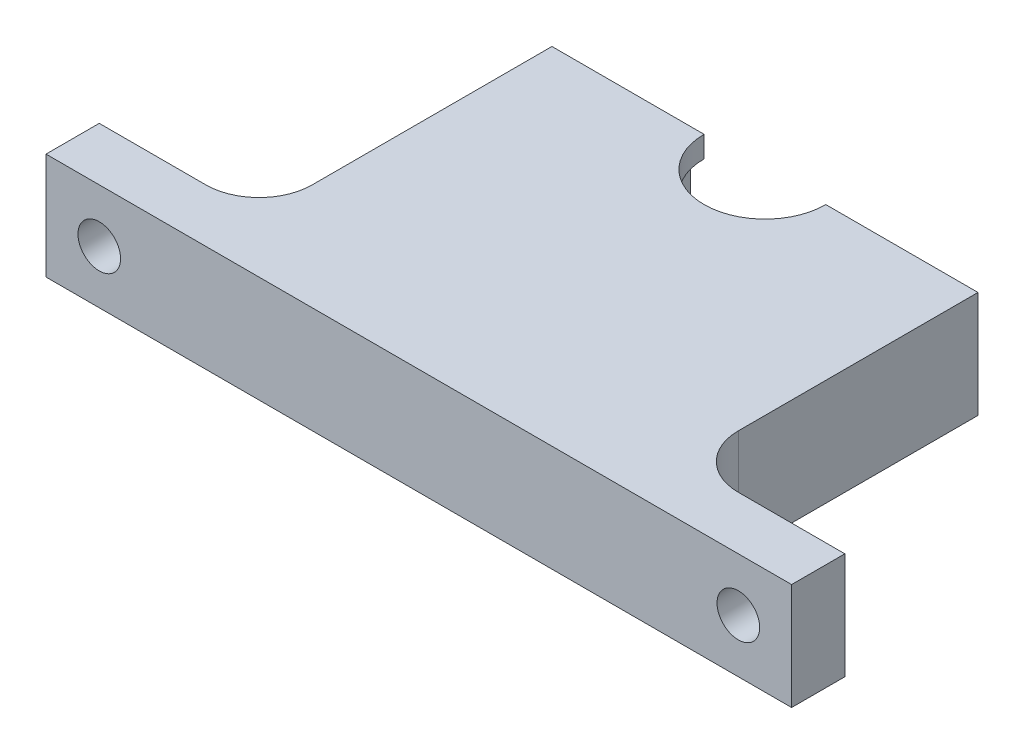
ISO-10303-21;
HEADER;
FILE_DESCRIPTION(('STEP AP214'),'2;1');
FILE_NAME('part.step','',(''),(''),'','','');
FILE_SCHEMA(('AUTOMOTIVE_DESIGN { 1 0 10303 214 1 1 1 1 }'));
ENDSEC;
DATA;
#1=APPLICATION_CONTEXT('core data for automotive mechanical design processes');
#2=APPLICATION_PROTOCOL_DEFINITION('international standard','automotive_design',2000,#1);
#3=PRODUCT_CONTEXT('',#1,'mechanical');
#4=PRODUCT('Part','Part','',(#3));
#5=PRODUCT_RELATED_PRODUCT_CATEGORY('part','',(#4));
#6=PRODUCT_DEFINITION_FORMATION('','',#4);
#7=PRODUCT_DEFINITION_CONTEXT('part definition',#1,'design');
#8=PRODUCT_DEFINITION('design','',#6,#7);
#9=PRODUCT_DEFINITION_SHAPE('','',#8);
#10=(LENGTH_UNIT() NAMED_UNIT(*) SI_UNIT(.MILLI.,.METRE.));
#11=(NAMED_UNIT(*) PLANE_ANGLE_UNIT() SI_UNIT($,.RADIAN.));
#12=(NAMED_UNIT(*) SI_UNIT($,.STERADIAN.) SOLID_ANGLE_UNIT());
#13=UNCERTAINTY_MEASURE_WITH_UNIT(LENGTH_MEASURE(1.E-05),#10,'distance_accuracy_value','');
#14=(GEOMETRIC_REPRESENTATION_CONTEXT(3) GLOBAL_UNCERTAINTY_ASSIGNED_CONTEXT((#13)) GLOBAL_UNIT_ASSIGNED_CONTEXT((#10,
#11,#12)) REPRESENTATION_CONTEXT('',''));
#15=CARTESIAN_POINT('',(0.,0.,0.));
#16=DIRECTION('',(0.,0.,1.));
#17=DIRECTION('',(1.,0.,0.));
#18=AXIS2_PLACEMENT_3D('',#15,#16,#17);
#19=CARTESIAN_POINT('',(20.,5.,0.));
#20=DIRECTION('',(1.,0.,0.));
#21=DIRECTION('',(0.,0.,-1.));
#22=AXIS2_PLACEMENT_3D('',#19,#20,#21);
#23=PLANE('',#22);
#24=DIRECTION('',(0.,0.,1.));
#25=VECTOR('',#24,1.);
#26=CARTESIAN_POINT('',(20.,5.,0.));
#27=LINE('',#26,#25);
#28=CARTESIAN_POINT('',(20.,5.,0.));
#29=VERTEX_POINT('',#28);
#30=CARTESIAN_POINT('',(20.,5.,22.5));
#31=VERTEX_POINT('',#30);
#32=EDGE_CURVE('E279',#29,#31,#27,.T.);
#33=ORIENTED_EDGE('',*,*,#32,.T.);
#34=DIRECTION('',(0.,-1.,0.));
#35=VECTOR('',#34,1.);
#36=CARTESIAN_POINT('',(20.,-5.,22.5));
#37=LINE('',#36,#35);
#38=CARTESIAN_POINT('',(20.,-5.,22.5));
#39=VERTEX_POINT('',#38);
#40=EDGE_CURVE('E334',#31,#39,#37,.T.);
#41=ORIENTED_EDGE('',*,*,#40,.T.);
#42=DIRECTION('',(0.,0.,1.));
#43=VECTOR('',#42,1.);
#44=CARTESIAN_POINT('',(20.,-5.,0.));
#45=LINE('',#44,#43);
#46=CARTESIAN_POINT('',(20.,-5.,0.));
#47=VERTEX_POINT('',#46);
#48=EDGE_CURVE('E301',#47,#39,#45,.T.);
#49=ORIENTED_EDGE('',*,*,#48,.F.);
#50=DIRECTION('',(0.,-1.,0.));
#51=VECTOR('',#50,1.);
#52=CARTESIAN_POINT('',(20.,5.,0.));
#53=LINE('',#52,#51);
#54=EDGE_CURVE('E312',#29,#47,#53,.T.);
#55=ORIENTED_EDGE('',*,*,#54,.F.);
#56=EDGE_LOOP('',(#33,#41,#49,#55));
#57=FACE_BOUND('',#56,.T.);
#58=ADVANCED_FACE('F40',(#57),#23,.T.);
#59=CARTESIAN_POINT('',(-20.,5.,0.));
#60=DIRECTION('',(-1.,0.,0.));
#61=DIRECTION('',(0.,0.,1.));
#62=AXIS2_PLACEMENT_3D('',#59,#60,#61);
#63=PLANE('',#62);
#64=DIRECTION('',(0.,0.,-1.));
#65=VECTOR('',#64,1.);
#66=CARTESIAN_POINT('',(-20.,-5.,0.));
#67=LINE('',#66,#65);
#68=CARTESIAN_POINT('',(-20.,-5.,22.5));
#69=VERTEX_POINT('',#68);
#70=CARTESIAN_POINT('',(-20.,-5.,0.));
#71=VERTEX_POINT('',#70);
#72=EDGE_CURVE('E295',#69,#71,#67,.T.);
#73=ORIENTED_EDGE('',*,*,#72,.F.);
#74=DIRECTION('',(0.,1.,0.));
#75=VECTOR('',#74,1.);
#76=CARTESIAN_POINT('',(-20.,5.,22.5));
#77=LINE('',#76,#75);
#78=CARTESIAN_POINT('',(-20.,5.,22.5));
#79=VERTEX_POINT('',#78);
#80=EDGE_CURVE('E340',#69,#79,#77,.T.);
#81=ORIENTED_EDGE('',*,*,#80,.T.);
#82=DIRECTION('',(0.,0.,-1.));
#83=VECTOR('',#82,1.);
#84=CARTESIAN_POINT('',(-20.,5.,0.));
#85=LINE('',#84,#83);
#86=CARTESIAN_POINT('',(-20.,5.,0.));
#87=VERTEX_POINT('',#86);
#88=EDGE_CURVE('E274',#79,#87,#85,.T.);
#89=ORIENTED_EDGE('',*,*,#88,.T.);
#90=DIRECTION('',(0.,-1.,0.));
#91=VECTOR('',#90,1.);
#92=CARTESIAN_POINT('',(-20.,5.,0.));
#93=LINE('',#92,#91);
#94=EDGE_CURVE('E315',#87,#71,#93,.T.);
#95=ORIENTED_EDGE('',*,*,#94,.T.);
#96=EDGE_LOOP('',(#73,#81,#89,#95));
#97=FACE_BOUND('',#96,.T.);
#98=ADVANCED_FACE('F381',(#97),#63,.T.);
#99=CARTESIAN_POINT('',(0.,5.,0.));
#100=DIRECTION('',(0.,-1.,0.));
#101=DIRECTION('',(0.,0.,-1.));
#102=AXIS2_PLACEMENT_3D('',#99,#100,#101);
#103=CYLINDRICAL_SURFACE('',#102,5.715);
#104=DIRECTION('',(0.,-1.,0.));
#105=VECTOR('',#104,1.);
#106=CARTESIAN_POINT('',(-5.715,5.,0.));
#107=LINE('',#106,#105);
#108=CARTESIAN_POINT('',(-5.715,-3.,0.));
#109=VERTEX_POINT('',#108);
#110=CARTESIAN_POINT('',(-5.715,-5.,0.));
#111=VERTEX_POINT('',#110);
#112=EDGE_CURVE('E319',#109,#111,#107,.T.);
#113=ORIENTED_EDGE('',*,*,#112,.F.);
#114=CARTESIAN_POINT('',(0.,-3.,0.));
#115=DIRECTION('',(0.,1.,0.));
#116=DIRECTION('',(0.,0.,1.));
#117=AXIS2_PLACEMENT_3D('',#114,#115,#116);
#118=CIRCLE('',#117,5.715);
#119=CARTESIAN_POINT('',(5.715,-3.,0.));
#120=VERTEX_POINT('',#119);
#121=EDGE_CURVE('E253',#109,#120,#118,.T.);
#122=ORIENTED_EDGE('',*,*,#121,.T.);
#123=DIRECTION('',(0.,-1.,0.));
#124=VECTOR('',#123,1.);
#125=CARTESIAN_POINT('',(5.715,5.,0.));
#126=LINE('',#125,#124);
#127=CARTESIAN_POINT('',(5.715,-5.,0.));
#128=VERTEX_POINT('',#127);
#129=EDGE_CURVE('E287',#120,#128,#126,.T.);
#130=ORIENTED_EDGE('',*,*,#129,.T.);
#131=CARTESIAN_POINT('',(0.,-5.,0.));
#132=DIRECTION('',(0.,1.,0.));
#133=DIRECTION('',(0.,0.,1.));
#134=AXIS2_PLACEMENT_3D('',#131,#132,#133);
#135=CIRCLE('',#134,5.715);
#136=EDGE_CURVE('E264',#111,#128,#135,.T.);
#137=ORIENTED_EDGE('',*,*,#136,.F.);
#138=EDGE_LOOP('',(#113,#122,#130,#137));
#139=FACE_BOUND('',#138,.T.);
#140=ADVANCED_FACE('F358',(#139),#103,.F.);
#141=CARTESIAN_POINT('',(0.,5.,0.));
#142=DIRECTION('',(0.,0.,-1.));
#143=DIRECTION('',(-1.,0.,0.));
#144=AXIS2_PLACEMENT_3D('',#141,#142,#143);
#145=PLANE('',#144);
#146=CARTESIAN_POINT('',(-15.,1.02348685082632E-13,0.));
#147=DIRECTION('',(0.,0.,-1.));
#148=DIRECTION('',(1.,0.,0.));
#149=AXIS2_PLACEMENT_3D('',#146,#147,#148);
#150=CIRCLE('',#149,1.5);
#151=CARTESIAN_POINT('',(-13.5,1.02348685082632E-13,0.));
#152=VERTEX_POINT('',#151);
#153=EDGE_CURVE('E221',#152,#152,#150,.T.);
#154=ORIENTED_EDGE('',*,*,#153,.F.);
#155=EDGE_LOOP('',(#154));
#156=FACE_BOUND('',#155,.T.);
#157=DIRECTION('',(0.,1.,0.));
#158=VECTOR('',#157,1.);
#159=CARTESIAN_POINT('',(-6.985,-3.,0.));
#160=LINE('',#159,#158);
#161=CARTESIAN_POINT('',(-6.985,-3.,0.));
#162=VERTEX_POINT('',#161);
#163=CARTESIAN_POINT('',(-6.985,3.,0.));
#164=VERTEX_POINT('',#163);
#165=EDGE_CURVE('E261',#162,#164,#160,.T.);
#166=ORIENTED_EDGE('',*,*,#165,.F.);
#167=DIRECTION('',(1.,0.,0.));
#168=VECTOR('',#167,1.);
#169=CARTESIAN_POINT('',(0.,-3.,0.));
#170=LINE('',#169,#168);
#171=EDGE_CURVE('E257',#162,#109,#170,.T.);
#172=ORIENTED_EDGE('',*,*,#171,.T.);
#173=ORIENTED_EDGE('',*,*,#112,.T.);
#174=DIRECTION('',(1.,0.,0.));
#175=VECTOR('',#174,1.);
#176=CARTESIAN_POINT('',(0.,-5.,0.));
#177=LINE('',#176,#175);
#178=EDGE_CURVE('E291',#71,#111,#177,.T.);
#179=ORIENTED_EDGE('',*,*,#178,.F.);
#180=ORIENTED_EDGE('',*,*,#94,.F.);
#181=DIRECTION('',(1.,0.,0.));
#182=VECTOR('',#181,1.);
#183=CARTESIAN_POINT('',(0.,5.,0.));
#184=LINE('',#183,#182);
#185=CARTESIAN_POINT('',(-5.715,5.,0.));
#186=VERTEX_POINT('',#185);
#187=EDGE_CURVE('E269',#87,#186,#184,.T.);
#188=ORIENTED_EDGE('',*,*,#187,.T.);
#189=CARTESIAN_POINT('',(-5.715,3.,0.));
#190=VERTEX_POINT('',#189);
#191=EDGE_CURVE('E320',#186,#190,#107,.T.);
#192=ORIENTED_EDGE('',*,*,#191,.T.);
#193=DIRECTION('',(1.,0.,0.));
#194=VECTOR('',#193,1.);
#195=CARTESIAN_POINT('',(0.,3.,0.));
#196=LINE('',#195,#194);
#197=EDGE_CURVE('E250',#164,#190,#196,.T.);
#198=ORIENTED_EDGE('',*,*,#197,.F.);
#199=EDGE_LOOP('',(#166,#172,#173,#179,#180,#188,#192,#198));
#200=FACE_BOUND('',#199,.T.);
#201=ADVANCED_FACE('F377',(#156,#200),#145,.T.);
#202=CARTESIAN_POINT('',(0.,5.,0.));
#203=DIRECTION('',(0.,0.,-1.));
#204=DIRECTION('',(-1.,0.,0.));
#205=AXIS2_PLACEMENT_3D('',#202,#203,#204);
#206=PLANE('',#205);
#207=CARTESIAN_POINT('',(15.,0.,0.));
#208=DIRECTION('',(0.,0.,-1.));
#209=DIRECTION('',(-1.,0.,0.));
#210=AXIS2_PLACEMENT_3D('',#207,#208,#209);
#211=CIRCLE('',#210,1.5);
#212=CARTESIAN_POINT('',(13.5,0.,0.));
#213=VERTEX_POINT('',#212);
#214=EDGE_CURVE('E229',#213,#213,#211,.T.);
#215=ORIENTED_EDGE('',*,*,#214,.F.);
#216=EDGE_LOOP('',(#215));
#217=FACE_BOUND('',#216,.T.);
#218=ORIENTED_EDGE('',*,*,#129,.F.);
#219=DIRECTION('',(1.,0.,0.));
#220=VECTOR('',#219,1.);
#221=CARTESIAN_POINT('',(0.,-3.,0.));
#222=LINE('',#221,#220);
#223=CARTESIAN_POINT('',(6.985,-3.,0.));
#224=VERTEX_POINT('',#223);
#225=EDGE_CURVE('E330',#120,#224,#222,.T.);
#226=ORIENTED_EDGE('',*,*,#225,.T.);
#227=DIRECTION('',(0.,1.,0.));
#228=VECTOR('',#227,1.);
#229=CARTESIAN_POINT('',(6.985,-3.,0.));
#230=LINE('',#229,#228);
#231=CARTESIAN_POINT('',(6.985,3.,0.));
#232=VERTEX_POINT('',#231);
#233=EDGE_CURVE('E327',#232,#224,#230,.F.);
#234=ORIENTED_EDGE('',*,*,#233,.F.);
#235=DIRECTION('',(1.,0.,0.));
#236=VECTOR('',#235,1.);
#237=CARTESIAN_POINT('',(0.,3.,0.));
#238=LINE('',#237,#236);
#239=CARTESIAN_POINT('',(5.715,3.,0.));
#240=VERTEX_POINT('',#239);
#241=EDGE_CURVE('E324',#240,#232,#238,.T.);
#242=ORIENTED_EDGE('',*,*,#241,.F.);
#243=CARTESIAN_POINT('',(5.715,5.,0.));
#244=VERTEX_POINT('',#243);
#245=EDGE_CURVE('E308',#244,#240,#126,.T.);
#246=ORIENTED_EDGE('',*,*,#245,.F.);
#247=DIRECTION('',(1.,0.,0.));
#248=VECTOR('',#247,1.);
#249=CARTESIAN_POINT('',(0.,5.,0.));
#250=LINE('',#249,#248);
#251=EDGE_CURVE('E283',#244,#29,#250,.T.);
#252=ORIENTED_EDGE('',*,*,#251,.T.);
#253=ORIENTED_EDGE('',*,*,#54,.T.);
#254=DIRECTION('',(1.,0.,0.));
#255=VECTOR('',#254,1.);
#256=CARTESIAN_POINT('',(0.,-5.,0.));
#257=LINE('',#256,#255);
#258=EDGE_CURVE('E270',#128,#47,#257,.T.);
#259=ORIENTED_EDGE('',*,*,#258,.F.);
#260=EDGE_LOOP('',(#218,#226,#234,#242,#246,#252,#253,#259));
#261=FACE_BOUND('',#260,.T.);
#262=ADVANCED_FACE('F364',(#217,#261),#206,.T.);
#263=CARTESIAN_POINT('',(0.,3.,0.));
#264=DIRECTION('',(0.,1.,0.));
#265=DIRECTION('',(0.,0.,1.));
#266=AXIS2_PLACEMENT_3D('',#263,#264,#265);
#267=CIRCLE('',#266,5.715);
#268=EDGE_CURVE('E244',#190,#240,#267,.T.);
#269=ORIENTED_EDGE('',*,*,#268,.F.);
#270=ORIENTED_EDGE('',*,*,#191,.F.);
#271=CARTESIAN_POINT('',(0.,5.,0.));
#272=DIRECTION('',(0.,1.,0.));
#273=DIRECTION('',(0.,0.,1.));
#274=AXIS2_PLACEMENT_3D('',#271,#272,#273);
#275=CIRCLE('',#274,5.715);
#276=EDGE_CURVE('E265',#186,#244,#275,.T.);
#277=ORIENTED_EDGE('',*,*,#276,.T.);
#278=ORIENTED_EDGE('',*,*,#245,.T.);
#279=EDGE_LOOP('',(#269,#270,#277,#278));
#280=FACE_BOUND('',#279,.T.);
#281=ADVANCED_FACE('F395',(#280),#103,.F.);
#282=CARTESIAN_POINT('',(0.,5.,32.5));
#283=DIRECTION('',(0.,0.,1.));
#284=DIRECTION('',(1.,0.,0.));
#285=AXIS2_PLACEMENT_3D('',#282,#283,#284);
#286=PLANE('',#285);
#287=DIRECTION('',(-1.,0.,0.));
#288=VECTOR('',#287,1.);
#289=CARTESIAN_POINT('',(0.,-5.,32.5));
#290=LINE('',#289,#288);
#291=CARTESIAN_POINT('',(35.,-5.,32.5));
#292=VERTEX_POINT('',#291);
#293=CARTESIAN_POINT('',(-35.,-5.,32.5));
#294=VERTEX_POINT('',#293);
#295=EDGE_CURVE('E298',#292,#294,#290,.T.);
#296=ORIENTED_EDGE('',*,*,#295,.F.);
#297=DIRECTION('',(0.,1.,0.));
#298=VECTOR('',#297,1.);
#299=CARTESIAN_POINT('',(35.,5.,32.5));
#300=LINE('',#299,#298);
#301=CARTESIAN_POINT('',(35.,5.,32.5));
#302=VERTEX_POINT('',#301);
#303=EDGE_CURVE('E181',#292,#302,#300,.T.);
#304=ORIENTED_EDGE('',*,*,#303,.T.);
#305=DIRECTION('',(-1.,0.,0.));
#306=VECTOR('',#305,1.);
#307=CARTESIAN_POINT('',(0.,5.,32.5));
#308=LINE('',#307,#306);
#309=CARTESIAN_POINT('',(-35.,5.,32.5));
#310=VERTEX_POINT('',#309);
#311=EDGE_CURVE('E159',#302,#310,#308,.T.);
#312=ORIENTED_EDGE('',*,*,#311,.T.);
#313=DIRECTION('',(0.,-1.,0.));
#314=VECTOR('',#313,1.);
#315=CARTESIAN_POINT('',(-35.,5.,32.5));
#316=LINE('',#315,#314);
#317=EDGE_CURVE('E199',#310,#294,#316,.T.);
#318=ORIENTED_EDGE('',*,*,#317,.T.);
#319=EDGE_LOOP('',(#296,#304,#312,#318));
#320=FACE_BOUND('',#319,.T.);
#321=CARTESIAN_POINT('',(-30.,0.,32.5));
#322=DIRECTION('',(0.,0.,1.));
#323=DIRECTION('',(1.,0.,0.));
#324=AXIS2_PLACEMENT_3D('',#321,#322,#323);
#325=CIRCLE('',#324,2.);
#326=CARTESIAN_POINT('',(-28.,0.,32.5));
#327=VERTEX_POINT('',#326);
#328=EDGE_CURVE('E193',#327,#327,#325,.T.);
#329=ORIENTED_EDGE('',*,*,#328,.F.);
#330=EDGE_LOOP('',(#329));
#331=FACE_BOUND('',#330,.T.);
#332=CARTESIAN_POINT('',(30.,0.,32.5));
#333=DIRECTION('',(0.,0.,1.));
#334=DIRECTION('',(-1.,0.,0.));
#335=AXIS2_PLACEMENT_3D('',#332,#333,#334);
#336=CIRCLE('',#335,2.00000000000004);
#337=CARTESIAN_POINT('',(28.,0.,32.5));
#338=VERTEX_POINT('',#337);
#339=EDGE_CURVE('E187',#338,#338,#336,.T.);
#340=ORIENTED_EDGE('',*,*,#339,.F.);
#341=EDGE_LOOP('',(#340));
#342=FACE_BOUND('',#341,.T.);
#343=ADVANCED_FACE('F392',(#320,#331,#342),#286,.T.);
#344=CARTESIAN_POINT('',(0.,5.,0.));
#345=DIRECTION('',(0.,1.,0.));
#346=DIRECTION('',(0.,0.,1.));
#347=AXIS2_PLACEMENT_3D('',#344,#345,#346);
#348=PLANE('',#347);
#349=ORIENTED_EDGE('',*,*,#276,.F.);
#350=ORIENTED_EDGE('',*,*,#187,.F.);
#351=ORIENTED_EDGE('',*,*,#88,.F.);
#352=CARTESIAN_POINT('',(-25.,5.,22.5));
#353=DIRECTION('',(0.,1.,0.));
#354=DIRECTION('',(0.,0.,1.));
#355=AXIS2_PLACEMENT_3D('',#352,#353,#354);
#356=CIRCLE('',#355,5.);
#357=CARTESIAN_POINT('',(-25.,5.,27.5));
#358=VERTEX_POINT('',#357);
#359=EDGE_CURVE('E49',#79,#358,#356,.F.);
#360=ORIENTED_EDGE('',*,*,#359,.T.);
#361=DIRECTION('',(-1.,0.,0.));
#362=VECTOR('',#361,1.);
#363=CARTESIAN_POINT('',(-35.,5.,27.5));
#364=LINE('',#363,#362);
#365=CARTESIAN_POINT('',(-35.,5.,27.5));
#366=VERTEX_POINT('',#365);
#367=EDGE_CURVE('E203',#358,#366,#364,.T.);
#368=ORIENTED_EDGE('',*,*,#367,.T.);
#369=DIRECTION('',(0.,0.,1.));
#370=VECTOR('',#369,1.);
#371=CARTESIAN_POINT('',(-35.,5.,27.5));
#372=LINE('',#371,#370);
#373=EDGE_CURVE('E213',#366,#310,#372,.T.);
#374=ORIENTED_EDGE('',*,*,#373,.T.);
#375=ORIENTED_EDGE('',*,*,#311,.F.);
#376=DIRECTION('',(0.,0.,1.));
#377=VECTOR('',#376,1.);
#378=CARTESIAN_POINT('',(35.,5.,27.5));
#379=LINE('',#378,#377);
#380=CARTESIAN_POINT('',(35.,5.,27.5));
#381=VERTEX_POINT('',#380);
#382=EDGE_CURVE('E152',#381,#302,#379,.T.);
#383=ORIENTED_EDGE('',*,*,#382,.F.);
#384=DIRECTION('',(-1.,0.,0.));
#385=VECTOR('',#384,1.);
#386=CARTESIAN_POINT('',(35.,5.,27.5));
#387=LINE('',#386,#385);
#388=CARTESIAN_POINT('',(25.,5.00000000000009,27.5));
#389=VERTEX_POINT('',#388);
#390=EDGE_CURVE('E156',#381,#389,#387,.T.);
#391=ORIENTED_EDGE('',*,*,#390,.T.);
#392=CARTESIAN_POINT('',(25.,5.,22.5));
#393=DIRECTION('',(0.,1.,0.));
#394=DIRECTION('',(0.,0.,1.));
#395=AXIS2_PLACEMENT_3D('',#392,#393,#394);
#396=CIRCLE('',#395,5.);
#397=EDGE_CURVE('E349',#389,#31,#396,.F.);
#398=ORIENTED_EDGE('',*,*,#397,.T.);
#399=ORIENTED_EDGE('',*,*,#32,.F.);
#400=ORIENTED_EDGE('',*,*,#251,.F.);
#401=EDGE_LOOP('',(#349,#350,#351,#360,#368,#374,#375,#383,#391,#398,#399,#400));
#402=FACE_BOUND('',#401,.T.);
#403=ADVANCED_FACE('F155',(#402),#348,.T.);
#404=CARTESIAN_POINT('',(0.,-5.,0.));
#405=DIRECTION('',(0.,1.,0.));
#406=DIRECTION('',(0.,0.,1.));
#407=AXIS2_PLACEMENT_3D('',#404,#405,#406);
#408=PLANE('',#407);
#409=ORIENTED_EDGE('',*,*,#136,.T.);
#410=ORIENTED_EDGE('',*,*,#258,.T.);
#411=ORIENTED_EDGE('',*,*,#48,.T.);
#412=CARTESIAN_POINT('',(25.,-5.,22.5));
#413=DIRECTION('',(0.,1.,0.));
#414=DIRECTION('',(0.,0.,1.));
#415=AXIS2_PLACEMENT_3D('',#412,#413,#414);
#416=CIRCLE('',#415,5.);
#417=CARTESIAN_POINT('',(25.,-4.99999999999991,27.5));
#418=VERTEX_POINT('',#417);
#419=EDGE_CURVE('E346',#39,#418,#416,.T.);
#420=ORIENTED_EDGE('',*,*,#419,.T.);
#421=DIRECTION('',(1.,0.,0.));
#422=VECTOR('',#421,1.);
#423=CARTESIAN_POINT('',(35.,-5.,27.5));
#424=LINE('',#423,#422);
#425=CARTESIAN_POINT('',(35.,-5.,27.5));
#426=VERTEX_POINT('',#425);
#427=EDGE_CURVE('E166',#418,#426,#424,.T.);
#428=ORIENTED_EDGE('',*,*,#427,.T.);
#429=DIRECTION('',(0.,0.,1.));
#430=VECTOR('',#429,1.);
#431=CARTESIAN_POINT('',(35.,-5.,27.5));
#432=LINE('',#431,#430);
#433=EDGE_CURVE('E165',#426,#292,#432,.T.);
#434=ORIENTED_EDGE('',*,*,#433,.T.);
#435=ORIENTED_EDGE('',*,*,#295,.T.);
#436=DIRECTION('',(0.,0.,1.));
#437=VECTOR('',#436,1.);
#438=CARTESIAN_POINT('',(-35.,-5.,27.5));
#439=LINE('',#438,#437);
#440=CARTESIAN_POINT('',(-35.,-5.,27.5));
#441=VERTEX_POINT('',#440);
#442=EDGE_CURVE('E217',#441,#294,#439,.T.);
#443=ORIENTED_EDGE('',*,*,#442,.F.);
#444=DIRECTION('',(1.,0.,0.));
#445=VECTOR('',#444,1.);
#446=CARTESIAN_POINT('',(-35.,-5.,27.5));
#447=LINE('',#446,#445);
#448=CARTESIAN_POINT('',(-25.,-5.,27.5));
#449=VERTEX_POINT('',#448);
#450=EDGE_CURVE('E210',#441,#449,#447,.T.);
#451=ORIENTED_EDGE('',*,*,#450,.T.);
#452=CARTESIAN_POINT('',(-25.,-5.,22.5));
#453=DIRECTION('',(0.,1.,0.));
#454=DIRECTION('',(0.,0.,1.));
#455=AXIS2_PLACEMENT_3D('',#452,#453,#454);
#456=CIRCLE('',#455,5.);
#457=EDGE_CURVE('E11',#449,#69,#456,.T.);
#458=ORIENTED_EDGE('',*,*,#457,.T.);
#459=ORIENTED_EDGE('',*,*,#72,.T.);
#460=ORIENTED_EDGE('',*,*,#178,.T.);
#461=EDGE_LOOP('',(#409,#410,#411,#420,#428,#434,#435,#443,#451,#458,#459,#460));
#462=FACE_BOUND('',#461,.T.);
#463=ADVANCED_FACE('F362',(#462),#408,.F.);
#464=CARTESIAN_POINT('',(0.,-3.,0.));
#465=DIRECTION('',(0.,1.,0.));
#466=DIRECTION('',(0.,0.,1.));
#467=AXIS2_PLACEMENT_3D('',#464,#465,#466);
#468=CYLINDRICAL_SURFACE('',#467,6.985);
#469=ORIENTED_EDGE('',*,*,#165,.T.);
#470=CARTESIAN_POINT('',(0.,3.,0.));
#471=DIRECTION('',(0.,1.,0.));
#472=DIRECTION('',(0.,0.,1.));
#473=AXIS2_PLACEMENT_3D('',#470,#471,#472);
#474=CIRCLE('',#473,6.985);
#475=EDGE_CURVE('E228',#164,#232,#474,.T.);
#476=ORIENTED_EDGE('',*,*,#475,.T.);
#477=ORIENTED_EDGE('',*,*,#233,.T.);
#478=CARTESIAN_POINT('',(0.,-3.,0.));
#479=DIRECTION('',(0.,1.,0.));
#480=DIRECTION('',(0.,0.,1.));
#481=AXIS2_PLACEMENT_3D('',#478,#479,#480);
#482=CIRCLE('',#481,6.985);
#483=EDGE_CURVE('E240',#162,#224,#482,.T.);
#484=ORIENTED_EDGE('',*,*,#483,.F.);
#485=EDGE_LOOP('',(#469,#476,#477,#484));
#486=FACE_BOUND('',#485,.T.);
#487=ADVANCED_FACE('F571',(#486),#468,.F.);
#488=CARTESIAN_POINT('',(0.,-3.,0.));
#489=DIRECTION('',(0.,1.,0.));
#490=DIRECTION('',(0.,0.,1.));
#491=AXIS2_PLACEMENT_3D('',#488,#489,#490);
#492=PLANE('',#491);
#493=ORIENTED_EDGE('',*,*,#483,.T.);
#494=ORIENTED_EDGE('',*,*,#225,.F.);
#495=ORIENTED_EDGE('',*,*,#121,.F.);
#496=ORIENTED_EDGE('',*,*,#171,.F.);
#497=EDGE_LOOP('',(#493,#494,#495,#496));
#498=FACE_BOUND('',#497,.T.);
#499=ADVANCED_FACE('F614',(#498),#492,.T.);
#500=CARTESIAN_POINT('',(0.,3.,0.));
#501=DIRECTION('',(0.,1.,0.));
#502=DIRECTION('',(0.,0.,1.));
#503=AXIS2_PLACEMENT_3D('',#500,#501,#502);
#504=PLANE('',#503);
#505=ORIENTED_EDGE('',*,*,#197,.T.);
#506=ORIENTED_EDGE('',*,*,#268,.T.);
#507=ORIENTED_EDGE('',*,*,#241,.T.);
#508=ORIENTED_EDGE('',*,*,#475,.F.);
#509=EDGE_LOOP('',(#505,#506,#507,#508));
#510=FACE_BOUND('',#509,.T.);
#511=ADVANCED_FACE('F460',(#510),#504,.F.);
#512=CARTESIAN_POINT('',(15.,0.,10.));
#513=DIRECTION('',(0.,0.,-1.));
#514=DIRECTION('',(-1.,0.,0.));
#515=AXIS2_PLACEMENT_3D('',#512,#513,#514);
#516=CYLINDRICAL_SURFACE('',#515,1.5);
#517=CARTESIAN_POINT('',(15.,0.,10.));
#518=DIRECTION('',(0.,0.,-1.));
#519=DIRECTION('',(-1.,0.,0.));
#520=AXIS2_PLACEMENT_3D('',#517,#518,#519);
#521=CIRCLE('',#520,1.5);
#522=CARTESIAN_POINT('',(13.5,0.,10.));
#523=VERTEX_POINT('',#522);
#524=EDGE_CURVE('E224',#523,#523,#521,.T.);
#525=ORIENTED_EDGE('',*,*,#524,.F.);
#526=EDGE_LOOP('',(#525));
#527=FACE_BOUND('',#526,.T.);
#528=ORIENTED_EDGE('',*,*,#214,.T.);
#529=EDGE_LOOP('',(#528));
#530=FACE_BOUND('',#529,.T.);
#531=ADVANCED_FACE('F454',(#527,#530),#516,.F.);
#532=CARTESIAN_POINT('',(15.,0.,10.));
#533=DIRECTION('',(0.,0.,-1.));
#534=DIRECTION('',(-1.,0.,0.));
#535=AXIS2_PLACEMENT_3D('',#532,#533,#534);
#536=PLANE('',#535);
#537=ORIENTED_EDGE('',*,*,#524,.T.);
#538=EDGE_LOOP('',(#537));
#539=FACE_BOUND('',#538,.T.);
#540=ADVANCED_FACE('F459',(#539),#536,.T.);
#541=CARTESIAN_POINT('',(-15.,1.02348685082632E-13,10.));
#542=DIRECTION('',(0.,0.,-1.));
#543=DIRECTION('',(-1.,0.,0.));
#544=AXIS2_PLACEMENT_3D('',#541,#542,#543);
#545=CYLINDRICAL_SURFACE('',#544,1.5);
#546=CARTESIAN_POINT('',(-15.,1.02348685082632E-13,10.));
#547=DIRECTION('',(0.,0.,-1.));
#548=DIRECTION('',(1.,0.,0.));
#549=AXIS2_PLACEMENT_3D('',#546,#547,#548);
#550=CIRCLE('',#549,1.5);
#551=CARTESIAN_POINT('',(-13.5,1.02348685082632E-13,10.));
#552=VERTEX_POINT('',#551);
#553=EDGE_CURVE('E233',#552,#552,#550,.T.);
#554=ORIENTED_EDGE('',*,*,#553,.F.);
#555=EDGE_LOOP('',(#554));
#556=FACE_BOUND('',#555,.T.);
#557=ORIENTED_EDGE('',*,*,#153,.T.);
#558=EDGE_LOOP('',(#557));
#559=FACE_BOUND('',#558,.T.);
#560=ADVANCED_FACE('F472',(#556,#559),#545,.F.);
#561=CARTESIAN_POINT('',(-15.,1.02348685082632E-13,10.));
#562=DIRECTION('',(0.,0.,1.));
#563=DIRECTION('',(1.,0.,0.));
#564=AXIS2_PLACEMENT_3D('',#561,#562,#563);
#565=PLANE('',#564);
#566=ORIENTED_EDGE('',*,*,#553,.T.);
#567=EDGE_LOOP('',(#566));
#568=FACE_BOUND('',#567,.T.);
#569=ADVANCED_FACE('F482',(#568),#565,.F.);
#570=CARTESIAN_POINT('',(-35.,5.,27.5));
#571=DIRECTION('',(-1.,0.,0.));
#572=DIRECTION('',(0.,0.,1.));
#573=AXIS2_PLACEMENT_3D('',#570,#571,#572);
#574=PLANE('',#573);
#575=ORIENTED_EDGE('',*,*,#317,.F.);
#576=ORIENTED_EDGE('',*,*,#373,.F.);
#577=DIRECTION('',(0.,-1.,0.));
#578=VECTOR('',#577,1.);
#579=CARTESIAN_POINT('',(-35.,5.,27.5));
#580=LINE('',#579,#578);
#581=EDGE_CURVE('E206',#366,#441,#580,.T.);
#582=ORIENTED_EDGE('',*,*,#581,.T.);
#583=ORIENTED_EDGE('',*,*,#442,.T.);
#584=EDGE_LOOP('',(#575,#576,#582,#583));
#585=FACE_BOUND('',#584,.T.);
#586=ADVANCED_FACE('F390',(#585),#574,.T.);
#587=CARTESIAN_POINT('',(0.,0.,27.5));
#588=DIRECTION('',(0.,0.,1.));
#589=DIRECTION('',(1.,0.,0.));
#590=AXIS2_PLACEMENT_3D('',#587,#588,#589);
#591=PLANE('',#590);
#592=CARTESIAN_POINT('',(-30.,0.,27.5));
#593=DIRECTION('',(0.,0.,1.));
#594=DIRECTION('',(1.,0.,0.));
#595=AXIS2_PLACEMENT_3D('',#592,#593,#594);
#596=CIRCLE('',#595,2.);
#597=CARTESIAN_POINT('',(-28.,0.,27.5));
#598=VERTEX_POINT('',#597);
#599=EDGE_CURVE('E195',#598,#598,#596,.T.);
#600=ORIENTED_EDGE('',*,*,#599,.T.);
#601=EDGE_LOOP('',(#600));
#602=FACE_BOUND('',#601,.T.);
#603=ORIENTED_EDGE('',*,*,#367,.F.);
#604=DIRECTION('',(0.,1.,0.));
#605=VECTOR('',#604,1.);
#606=CARTESIAN_POINT('',(-25.,0.,27.5));
#607=LINE('',#606,#605);
#608=EDGE_CURVE('E62',#358,#449,#607,.F.);
#609=ORIENTED_EDGE('',*,*,#608,.T.);
#610=ORIENTED_EDGE('',*,*,#450,.F.);
#611=ORIENTED_EDGE('',*,*,#581,.F.);
#612=EDGE_LOOP('',(#603,#609,#610,#611));
#613=FACE_BOUND('',#612,.T.);
#614=ADVANCED_FACE('F386',(#602,#613),#591,.F.);
#615=CARTESIAN_POINT('',(-30.,0.,27.5));
#616=DIRECTION('',(0.,0.,1.));
#617=DIRECTION('',(1.,0.,0.));
#618=AXIS2_PLACEMENT_3D('',#615,#616,#617);
#619=CYLINDRICAL_SURFACE('',#618,2.);
#620=ORIENTED_EDGE('',*,*,#599,.F.);
#621=EDGE_LOOP('',(#620));
#622=FACE_BOUND('',#621,.T.);
#623=ORIENTED_EDGE('',*,*,#328,.T.);
#624=EDGE_LOOP('',(#623));
#625=FACE_BOUND('',#624,.T.);
#626=ADVANCED_FACE('F521',(#622,#625),#619,.F.);
#627=CARTESIAN_POINT('',(35.,5.,27.5));
#628=DIRECTION('',(1.,0.,0.));
#629=DIRECTION('',(0.,0.,-1.));
#630=AXIS2_PLACEMENT_3D('',#627,#628,#629);
#631=PLANE('',#630);
#632=ORIENTED_EDGE('',*,*,#303,.F.);
#633=ORIENTED_EDGE('',*,*,#433,.F.);
#634=DIRECTION('',(0.,1.,0.));
#635=VECTOR('',#634,1.);
#636=CARTESIAN_POINT('',(35.,5.,27.5));
#637=LINE('',#636,#635);
#638=EDGE_CURVE('E172',#426,#381,#637,.T.);
#639=ORIENTED_EDGE('',*,*,#638,.T.);
#640=ORIENTED_EDGE('',*,*,#382,.T.);
#641=EDGE_LOOP('',(#632,#633,#639,#640));
#642=FACE_BOUND('',#641,.T.);
#643=ADVANCED_FACE('F178',(#642),#631,.T.);
#644=CARTESIAN_POINT('',(0.,0.,27.5));
#645=DIRECTION('',(0.,0.,-1.));
#646=DIRECTION('',(-1.,0.,0.));
#647=AXIS2_PLACEMENT_3D('',#644,#645,#646);
#648=PLANE('',#647);
#649=CARTESIAN_POINT('',(30.,0.,27.5));
#650=DIRECTION('',(0.,0.,1.));
#651=DIRECTION('',(-1.,0.,0.));
#652=AXIS2_PLACEMENT_3D('',#649,#650,#651);
#653=CIRCLE('',#652,2.00000000000004);
#654=CARTESIAN_POINT('',(28.,0.,27.5));
#655=VERTEX_POINT('',#654);
#656=EDGE_CURVE('E184',#655,#655,#653,.T.);
#657=ORIENTED_EDGE('',*,*,#656,.T.);
#658=EDGE_LOOP('',(#657));
#659=FACE_BOUND('',#658,.T.);
#660=ORIENTED_EDGE('',*,*,#427,.F.);
#661=DIRECTION('',(0.,-1.,0.));
#662=VECTOR('',#661,1.);
#663=CARTESIAN_POINT('',(25.,5.00000000000014,27.5));
#664=LINE('',#663,#662);
#665=EDGE_CURVE('E174',#418,#389,#664,.F.);
#666=ORIENTED_EDGE('',*,*,#665,.T.);
#667=ORIENTED_EDGE('',*,*,#390,.F.);
#668=ORIENTED_EDGE('',*,*,#638,.F.);
#669=EDGE_LOOP('',(#660,#666,#667,#668));
#670=FACE_BOUND('',#669,.T.);
#671=ADVANCED_FACE('F171',(#659,#670),#648,.T.);
#672=CARTESIAN_POINT('',(30.,0.,27.5));
#673=DIRECTION('',(0.,0.,1.));
#674=DIRECTION('',(1.,0.,0.));
#675=AXIS2_PLACEMENT_3D('',#672,#673,#674);
#676=CYLINDRICAL_SURFACE('',#675,2.00000000000004);
#677=ORIENTED_EDGE('',*,*,#656,.F.);
#678=EDGE_LOOP('',(#677));
#679=FACE_BOUND('',#678,.T.);
#680=ORIENTED_EDGE('',*,*,#339,.T.);
#681=EDGE_LOOP('',(#680));
#682=FACE_BOUND('',#681,.T.);
#683=ADVANCED_FACE('F408',(#679,#682),#676,.F.);
#684=CARTESIAN_POINT('',(25.,5.,22.5));
#685=DIRECTION('',(0.,1.,0.));
#686=DIRECTION('',(0.,0.,1.));
#687=AXIS2_PLACEMENT_3D('',#684,#685,#686);
#688=CYLINDRICAL_SURFACE('',#687,5.);
#689=ORIENTED_EDGE('',*,*,#397,.F.);
#690=ORIENTED_EDGE('',*,*,#665,.F.);
#691=ORIENTED_EDGE('',*,*,#419,.F.);
#692=ORIENTED_EDGE('',*,*,#40,.F.);
#693=EDGE_LOOP('',(#689,#690,#691,#692));
#694=FACE_BOUND('',#693,.T.);
#695=ADVANCED_FACE('F371',(#694),#688,.F.);
#696=CARTESIAN_POINT('',(-25.,5.,22.5));
#697=DIRECTION('',(0.,1.,0.));
#698=DIRECTION('',(0.,0.,1.));
#699=AXIS2_PLACEMENT_3D('',#696,#697,#698);
#700=CYLINDRICAL_SURFACE('',#699,5.);
#701=ORIENTED_EDGE('',*,*,#457,.F.);
#702=ORIENTED_EDGE('',*,*,#608,.F.);
#703=ORIENTED_EDGE('',*,*,#359,.F.);
#704=ORIENTED_EDGE('',*,*,#80,.F.);
#705=EDGE_LOOP('',(#701,#702,#703,#704));
#706=FACE_BOUND('',#705,.T.);
#707=ADVANCED_FACE('F42',(#706),#700,.F.);
#708=CLOSED_SHELL('',(#58,#98,#140,#201,#262,#281,#343,#403,#463,#487,#499,#511,#531,#540,#560,
#569,#586,#614,#626,#643,#671,#683,#695,#707));
#709=MANIFOLD_SOLID_BREP('B2',#708);
#710=ADVANCED_BREP_SHAPE_REPRESENTATION('',(#18,#709),#14);
#711=SHAPE_DEFINITION_REPRESENTATION(#9,#710);
ENDSEC;
END-ISO-10303-21;
